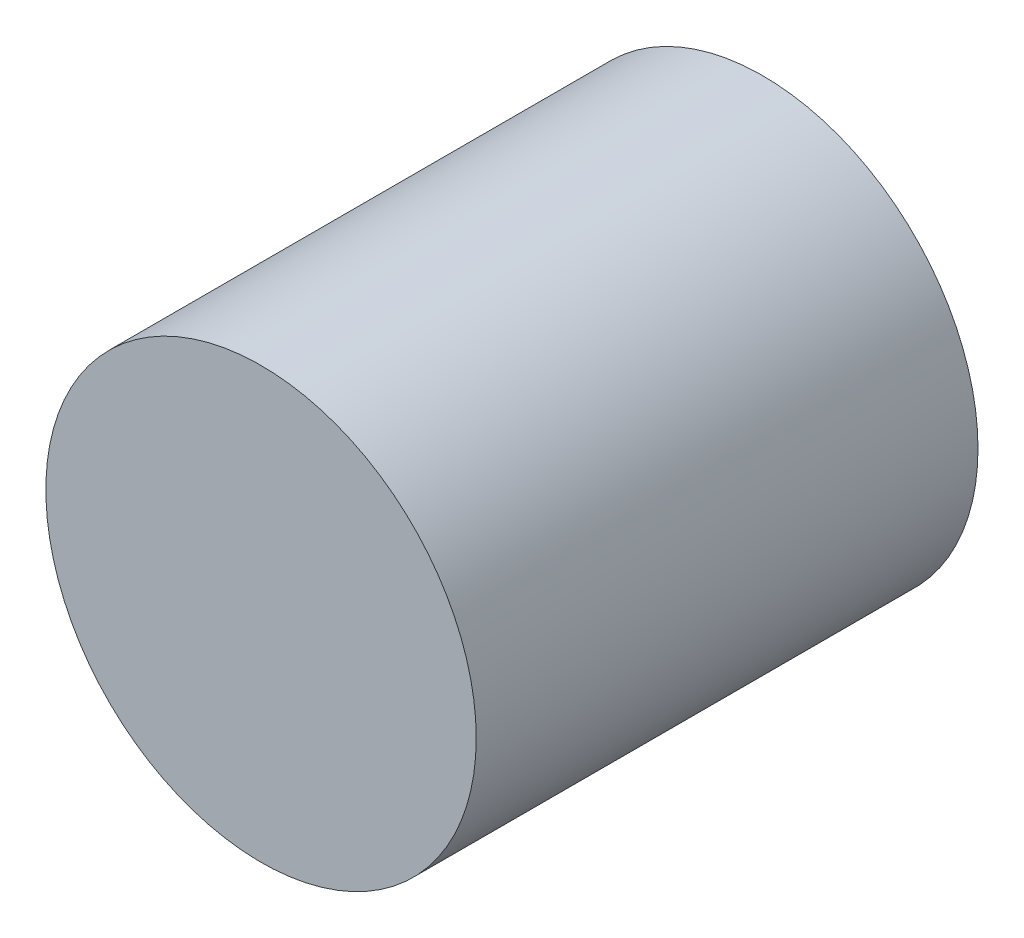
ISO-10303-21;
HEADER;
FILE_DESCRIPTION(('STEP AP214'),'2;1');
FILE_NAME('part.step','',(''),(''),'','','');
FILE_SCHEMA(('AUTOMOTIVE_DESIGN { 1 0 10303 214 1 1 1 1 }'));
ENDSEC;
DATA;
#1=APPLICATION_CONTEXT('core data for automotive mechanical design processes');
#2=APPLICATION_PROTOCOL_DEFINITION('international standard','automotive_design',2000,#1);
#3=PRODUCT_CONTEXT('',#1,'mechanical');
#4=PRODUCT('Part','Part','',(#3));
#5=PRODUCT_RELATED_PRODUCT_CATEGORY('part','',(#4));
#6=PRODUCT_DEFINITION_FORMATION('','',#4);
#7=PRODUCT_DEFINITION_CONTEXT('part definition',#1,'design');
#8=PRODUCT_DEFINITION('design','',#6,#7);
#9=PRODUCT_DEFINITION_SHAPE('','',#8);
#10=(LENGTH_UNIT() NAMED_UNIT(*) SI_UNIT(.MILLI.,.METRE.));
#11=(NAMED_UNIT(*) PLANE_ANGLE_UNIT() SI_UNIT($,.RADIAN.));
#12=(NAMED_UNIT(*) SI_UNIT($,.STERADIAN.) SOLID_ANGLE_UNIT());
#13=UNCERTAINTY_MEASURE_WITH_UNIT(LENGTH_MEASURE(1.E-05),#10,'distance_accuracy_value','');
#14=(GEOMETRIC_REPRESENTATION_CONTEXT(3) GLOBAL_UNCERTAINTY_ASSIGNED_CONTEXT((#13)) GLOBAL_UNIT_ASSIGNED_CONTEXT((#10,
#11,#12)) REPRESENTATION_CONTEXT('',''));
#15=CARTESIAN_POINT('',(0.,0.,0.));
#16=DIRECTION('',(0.,0.,1.));
#17=DIRECTION('',(1.,0.,0.));
#18=AXIS2_PLACEMENT_3D('',#15,#16,#17);
#19=CARTESIAN_POINT('',(0.,0.,14.8060564132778));
#20=DIRECTION('',(0.,0.,-1.));
#21=DIRECTION('',(-1.,0.,0.));
#22=AXIS2_PLACEMENT_3D('',#19,#20,#21);
#23=CYLINDRICAL_SURFACE('',#22,6.35);
#24=CARTESIAN_POINT('',(0.,0.,14.8060564132778));
#25=DIRECTION('',(0.,0.,1.));
#26=DIRECTION('',(1.,0.,0.));
#27=AXIS2_PLACEMENT_3D('',#24,#25,#26);
#28=CIRCLE('',#27,6.35);
#29=CARTESIAN_POINT('',(6.35,0.,14.8060564132778));
#30=VERTEX_POINT('',#29);
#31=EDGE_CURVE('E10',#30,#30,#28,.T.);
#32=ORIENTED_EDGE('',*,*,#31,.F.);
#33=EDGE_LOOP('',(#32));
#34=FACE_BOUND('',#33,.T.);
#35=CARTESIAN_POINT('',(0.,0.,0.));
#36=DIRECTION('',(0.,0.,1.));
#37=DIRECTION('',(1.,0.,0.));
#38=AXIS2_PLACEMENT_3D('',#35,#36,#37);
#39=CIRCLE('',#38,6.35);
#40=CARTESIAN_POINT('',(6.35,0.,0.));
#41=VERTEX_POINT('',#40);
#42=EDGE_CURVE('E38',#41,#41,#39,.T.);
#43=ORIENTED_EDGE('',*,*,#42,.T.);
#44=EDGE_LOOP('',(#43));
#45=FACE_BOUND('',#44,.T.);
#46=ADVANCED_FACE('F35',(#34,#45),#23,.T.);
#47=CARTESIAN_POINT('',(0.,0.,14.8060564132778));
#48=DIRECTION('',(0.,0.,1.));
#49=DIRECTION('',(1.,0.,0.));
#50=AXIS2_PLACEMENT_3D('',#47,#48,#49);
#51=PLANE('',#50);
#52=ORIENTED_EDGE('',*,*,#31,.T.);
#53=EDGE_LOOP('',(#52));
#54=FACE_BOUND('',#53,.T.);
#55=ADVANCED_FACE('F50',(#54),#51,.T.);
#56=CARTESIAN_POINT('',(0.,0.,0.));
#57=DIRECTION('',(0.,0.,1.));
#58=DIRECTION('',(1.,0.,0.));
#59=AXIS2_PLACEMENT_3D('',#56,#57,#58);
#60=PLANE('',#59);
#61=ORIENTED_EDGE('',*,*,#42,.F.);
#62=EDGE_LOOP('',(#61));
#63=FACE_BOUND('',#62,.T.);
#64=ADVANCED_FACE('F48',(#63),#60,.F.);
#65=CLOSED_SHELL('',(#46,#55,#64));
#66=MANIFOLD_SOLID_BREP('B2',#65);
#67=ADVANCED_BREP_SHAPE_REPRESENTATION('',(#18,#66),#14);
#68=SHAPE_DEFINITION_REPRESENTATION(#9,#67);
ENDSEC;
END-ISO-10303-21;
